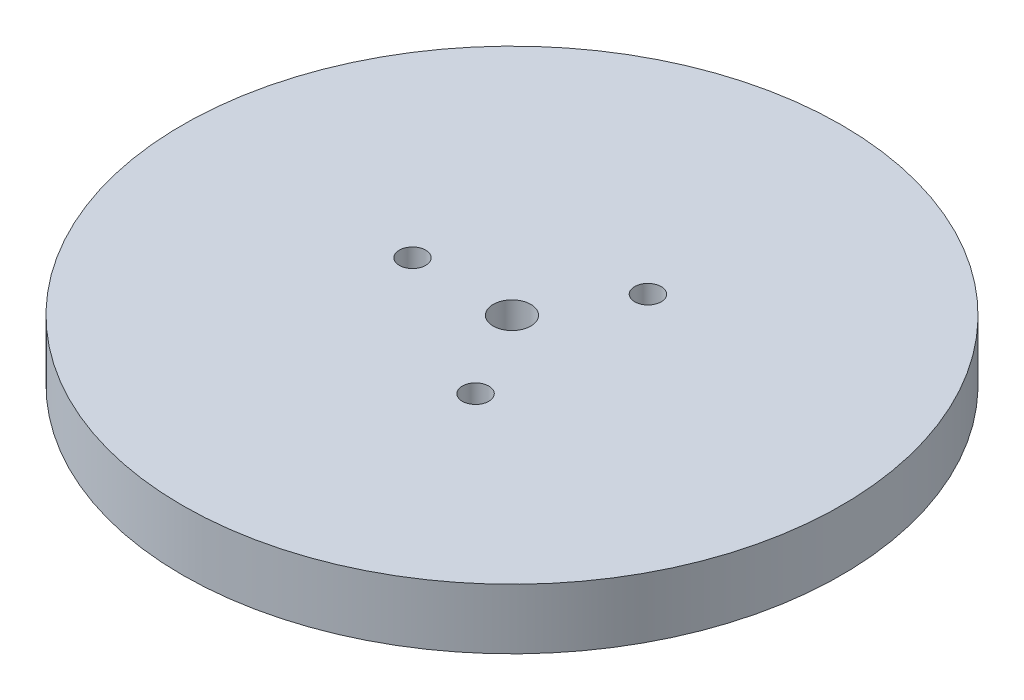
ISO-10303-21;
HEADER;
FILE_DESCRIPTION(('STEP AP214'),'2;1');
FILE_NAME('part.step','',(''),(''),'','','');
FILE_SCHEMA(('AUTOMOTIVE_DESIGN { 1 0 10303 214 1 1 1 1 }'));
ENDSEC;
DATA;
#1=APPLICATION_CONTEXT('core data for automotive mechanical design processes');
#2=APPLICATION_PROTOCOL_DEFINITION('international standard','automotive_design',2000,#1);
#3=PRODUCT_CONTEXT('',#1,'mechanical');
#4=PRODUCT('Part','Part','',(#3));
#5=PRODUCT_RELATED_PRODUCT_CATEGORY('part','',(#4));
#6=PRODUCT_DEFINITION_FORMATION('','',#4);
#7=PRODUCT_DEFINITION_CONTEXT('part definition',#1,'design');
#8=PRODUCT_DEFINITION('design','',#6,#7);
#9=PRODUCT_DEFINITION_SHAPE('','',#8);
#10=(LENGTH_UNIT() NAMED_UNIT(*) SI_UNIT(.MILLI.,.METRE.));
#11=(NAMED_UNIT(*) PLANE_ANGLE_UNIT() SI_UNIT($,.RADIAN.));
#12=(NAMED_UNIT(*) SI_UNIT($,.STERADIAN.) SOLID_ANGLE_UNIT());
#13=UNCERTAINTY_MEASURE_WITH_UNIT(LENGTH_MEASURE(1.E-05),#10,'distance_accuracy_value','');
#14=(GEOMETRIC_REPRESENTATION_CONTEXT(3) GLOBAL_UNCERTAINTY_ASSIGNED_CONTEXT((#13)) GLOBAL_UNIT_ASSIGNED_CONTEXT((#10,
#11,#12)) REPRESENTATION_CONTEXT('',''));
#15=CARTESIAN_POINT('',(0.,0.,0.));
#16=DIRECTION('',(0.,0.,1.));
#17=DIRECTION('',(1.,0.,0.));
#18=AXIS2_PLACEMENT_3D('',#15,#16,#17);
#19=CARTESIAN_POINT('',(0.,16.,0.));
#20=DIRECTION('',(0.,-1.,0.));
#21=DIRECTION('',(0.,0.,-1.));
#22=AXIS2_PLACEMENT_3D('',#19,#20,#21);
#23=CYLINDRICAL_SURFACE('',#22,87.5);
#24=CARTESIAN_POINT('',(0.,16.,0.));
#25=DIRECTION('',(0.,1.,0.));
#26=DIRECTION('',(0.,0.,1.));
#27=AXIS2_PLACEMENT_3D('',#24,#25,#26);
#28=CIRCLE('',#27,87.5);
#29=CARTESIAN_POINT('',(0.,16.,87.5));
#30=VERTEX_POINT('',#29);
#31=EDGE_CURVE('E10',#30,#30,#28,.T.);
#32=ORIENTED_EDGE('',*,*,#31,.F.);
#33=EDGE_LOOP('',(#32));
#34=FACE_BOUND('',#33,.T.);
#35=CARTESIAN_POINT('',(0.,0.,0.));
#36=DIRECTION('',(0.,1.,0.));
#37=DIRECTION('',(0.,0.,1.));
#38=AXIS2_PLACEMENT_3D('',#35,#36,#37);
#39=CIRCLE('',#38,87.5);
#40=CARTESIAN_POINT('',(0.,0.,87.5));
#41=VERTEX_POINT('',#40);
#42=EDGE_CURVE('E37',#41,#41,#39,.T.);
#43=ORIENTED_EDGE('',*,*,#42,.T.);
#44=EDGE_LOOP('',(#43));
#45=FACE_BOUND('',#44,.T.);
#46=ADVANCED_FACE('F40',(#34,#45),#23,.T.);
#47=CARTESIAN_POINT('',(0.,16.,0.));
#48=DIRECTION('',(0.,1.,0.));
#49=DIRECTION('',(0.,0.,1.));
#50=AXIS2_PLACEMENT_3D('',#47,#48,#49);
#51=PLANE('',#50);
#52=CARTESIAN_POINT('',(13.2089168199701,16.,22.8785150451391));
#53=DIRECTION('',(0.,1.,0.));
#54=DIRECTION('',(0.866025403784436,0.,-0.500000000000004));
#55=AXIS2_PLACEMENT_3D('',#52,#53,#54);
#56=CIRCLE('',#55,3.51501800398951);
#57=CARTESIAN_POINT('',(16.2530117061847,16.,21.1210060431443));
#58=VERTEX_POINT('',#57);
#59=EDGE_CURVE('E70',#58,#58,#56,.T.);
#60=ORIENTED_EDGE('',*,*,#59,.F.);
#61=EDGE_LOOP('',(#60));
#62=FACE_BOUND('',#61,.T.);
#63=CARTESIAN_POINT('',(13.2089168199698,16.,-22.8785150451393));
#64=DIRECTION('',(0.,1.,0.));
#65=DIRECTION('',(-0.866025403784443,0.,-0.499999999999992));
#66=AXIS2_PLACEMENT_3D('',#63,#64,#65);
#67=CIRCLE('',#66,3.51501800398951);
#68=CARTESIAN_POINT('',(10.1648219337552,16.,-24.636024047134));
#69=VERTEX_POINT('',#68);
#70=EDGE_CURVE('E61',#69,#69,#67,.T.);
#71=ORIENTED_EDGE('',*,*,#70,.F.);
#72=EDGE_LOOP('',(#71));
#73=FACE_BOUND('',#72,.T.);
#74=CARTESIAN_POINT('',(-26.41783363994,16.,0.));
#75=DIRECTION('',(0.,1.,0.));
#76=DIRECTION('',(0.,0.,1.));
#77=AXIS2_PLACEMENT_3D('',#74,#75,#76);
#78=CIRCLE('',#77,3.51501800398951);
#79=CARTESIAN_POINT('',(-26.41783363994,16.,3.51501800398951));
#80=VERTEX_POINT('',#79);
#81=EDGE_CURVE('E54',#80,#80,#78,.T.);
#82=ORIENTED_EDGE('',*,*,#81,.F.);
#83=EDGE_LOOP('',(#82));
#84=FACE_BOUND('',#83,.T.);
#85=CARTESIAN_POINT('',(0.,16.,0.));
#86=DIRECTION('',(0.,1.,0.));
#87=DIRECTION('',(0.,0.,1.));
#88=AXIS2_PLACEMENT_3D('',#85,#86,#87);
#89=CIRCLE('',#88,5.);
#90=CARTESIAN_POINT('',(0.,16.,5.));
#91=VERTEX_POINT('',#90);
#92=EDGE_CURVE('E50',#91,#91,#89,.T.);
#93=ORIENTED_EDGE('',*,*,#92,.F.);
#94=EDGE_LOOP('',(#93));
#95=FACE_BOUND('',#94,.T.);
#96=ORIENTED_EDGE('',*,*,#31,.T.);
#97=EDGE_LOOP('',(#96));
#98=FACE_BOUND('',#97,.T.);
#99=ADVANCED_FACE('F85',(#62,#73,#84,#95,#98),#51,.T.);
#100=CARTESIAN_POINT('',(0.,0.,0.));
#101=DIRECTION('',(0.,1.,0.));
#102=DIRECTION('',(0.,0.,1.));
#103=AXIS2_PLACEMENT_3D('',#100,#101,#102);
#104=PLANE('',#103);
#105=CARTESIAN_POINT('',(0.,0.,0.));
#106=DIRECTION('',(0.,1.,0.));
#107=DIRECTION('',(0.,0.,1.));
#108=AXIS2_PLACEMENT_3D('',#105,#106,#107);
#109=CIRCLE('',#108,5.);
#110=CARTESIAN_POINT('',(0.,0.,5.));
#111=VERTEX_POINT('',#110);
#112=EDGE_CURVE('E47',#111,#111,#109,.T.);
#113=ORIENTED_EDGE('',*,*,#112,.T.);
#114=EDGE_LOOP('',(#113));
#115=FACE_BOUND('',#114,.T.);
#116=ORIENTED_EDGE('',*,*,#42,.F.);
#117=EDGE_LOOP('',(#116));
#118=FACE_BOUND('',#117,.T.);
#119=ADVANCED_FACE('F84',(#115,#118),#104,.F.);
#120=CARTESIAN_POINT('',(0.,16.,0.));
#121=DIRECTION('',(0.,-1.,0.));
#122=DIRECTION('',(0.,0.,-1.));
#123=AXIS2_PLACEMENT_3D('',#120,#121,#122);
#124=CYLINDRICAL_SURFACE('',#123,5.);
#125=ORIENTED_EDGE('',*,*,#92,.T.);
#126=EDGE_LOOP('',(#125));
#127=FACE_BOUND('',#126,.T.);
#128=ORIENTED_EDGE('',*,*,#112,.F.);
#129=EDGE_LOOP('',(#128));
#130=FACE_BOUND('',#129,.T.);
#131=ADVANCED_FACE('F91',(#127,#130),#124,.F.);
#132=CARTESIAN_POINT('',(-26.41783363994,2.03994392830018,0.));
#133=DIRECTION('',(0.,1.,0.));
#134=DIRECTION('',(0.,0.,1.));
#135=AXIS2_PLACEMENT_3D('',#132,#133,#134);
#136=CYLINDRICAL_SURFACE('',#135,3.51501800398951);
#137=CARTESIAN_POINT('',(-26.41783363994,2.03994392830018,0.));
#138=DIRECTION('',(0.,1.,0.));
#139=DIRECTION('',(0.,0.,1.));
#140=AXIS2_PLACEMENT_3D('',#137,#138,#139);
#141=CIRCLE('',#140,3.51501800398951);
#142=CARTESIAN_POINT('',(-26.41783363994,2.03994392830018,3.51501800398951));
#143=VERTEX_POINT('',#142);
#144=EDGE_CURVE('E55',#143,#143,#141,.T.);
#145=ORIENTED_EDGE('',*,*,#144,.F.);
#146=EDGE_LOOP('',(#145));
#147=FACE_BOUND('',#146,.T.);
#148=ORIENTED_EDGE('',*,*,#81,.T.);
#149=EDGE_LOOP('',(#148));
#150=FACE_BOUND('',#149,.T.);
#151=ADVANCED_FACE('F96',(#147,#150),#136,.F.);
#152=CARTESIAN_POINT('',(-26.41783363994,2.03994392830018,0.));
#153=DIRECTION('',(0.,1.,0.));
#154=DIRECTION('',(0.,0.,1.));
#155=AXIS2_PLACEMENT_3D('',#152,#153,#154);
#156=PLANE('',#155);
#157=ORIENTED_EDGE('',*,*,#144,.T.);
#158=EDGE_LOOP('',(#157));
#159=FACE_BOUND('',#158,.T.);
#160=ADVANCED_FACE('F127',(#159),#156,.T.);
#161=CARTESIAN_POINT('',(13.2089168199698,2.03994392830018,-22.8785150451393));
#162=DIRECTION('',(0.,1.,0.));
#163=DIRECTION('',(0.,0.,1.));
#164=AXIS2_PLACEMENT_3D('',#161,#162,#163);
#165=CYLINDRICAL_SURFACE('',#164,3.51501800398951);
#166=CARTESIAN_POINT('',(13.2089168199698,2.03994392830018,-22.8785150451393));
#167=DIRECTION('',(0.,1.,0.));
#168=DIRECTION('',(-0.866025403784443,0.,-0.499999999999992));
#169=AXIS2_PLACEMENT_3D('',#166,#167,#168);
#170=CIRCLE('',#169,3.51501800398951);
#171=CARTESIAN_POINT('',(10.1648219337552,2.03994392830018,-24.636024047134));
#172=VERTEX_POINT('',#171);
#173=EDGE_CURVE('E63',#172,#172,#170,.T.);
#174=ORIENTED_EDGE('',*,*,#173,.F.);
#175=EDGE_LOOP('',(#174));
#176=FACE_BOUND('',#175,.T.);
#177=ORIENTED_EDGE('',*,*,#70,.T.);
#178=EDGE_LOOP('',(#177));
#179=FACE_BOUND('',#178,.T.);
#180=ADVANCED_FACE('F133',(#176,#179),#165,.F.);
#181=CARTESIAN_POINT('',(13.2089168199698,2.03994392830018,-22.8785150451393));
#182=DIRECTION('',(0.,1.,0.));
#183=DIRECTION('',(-0.866025403784443,0.,-0.499999999999992));
#184=AXIS2_PLACEMENT_3D('',#181,#182,#183);
#185=PLANE('',#184);
#186=ORIENTED_EDGE('',*,*,#173,.T.);
#187=EDGE_LOOP('',(#186));
#188=FACE_BOUND('',#187,.T.);
#189=ADVANCED_FACE('F77',(#188),#185,.T.);
#190=CARTESIAN_POINT('',(13.2089168199701,2.03994392830018,22.8785150451391));
#191=DIRECTION('',(0.,1.,0.));
#192=DIRECTION('',(0.,0.,1.));
#193=AXIS2_PLACEMENT_3D('',#190,#191,#192);
#194=CYLINDRICAL_SURFACE('',#193,3.51501800398951);
#195=CARTESIAN_POINT('',(13.2089168199701,2.03994392830018,22.8785150451391));
#196=DIRECTION('',(0.,1.,0.));
#197=DIRECTION('',(0.866025403784436,0.,-0.500000000000004));
#198=AXIS2_PLACEMENT_3D('',#195,#196,#197);
#199=CIRCLE('',#198,3.51501800398951);
#200=CARTESIAN_POINT('',(16.2530117061847,2.03994392830018,21.1210060431443));
#201=VERTEX_POINT('',#200);
#202=EDGE_CURVE('E59',#201,#201,#199,.T.);
#203=ORIENTED_EDGE('',*,*,#202,.F.);
#204=EDGE_LOOP('',(#203));
#205=FACE_BOUND('',#204,.T.);
#206=ORIENTED_EDGE('',*,*,#59,.T.);
#207=EDGE_LOOP('',(#206));
#208=FACE_BOUND('',#207,.T.);
#209=ADVANCED_FACE('F73',(#205,#208),#194,.F.);
#210=CARTESIAN_POINT('',(13.2089168199701,2.03994392830018,22.8785150451391));
#211=DIRECTION('',(0.,1.,0.));
#212=DIRECTION('',(0.866025403784436,0.,-0.500000000000004));
#213=AXIS2_PLACEMENT_3D('',#210,#211,#212);
#214=PLANE('',#213);
#215=ORIENTED_EDGE('',*,*,#202,.T.);
#216=EDGE_LOOP('',(#215));
#217=FACE_BOUND('',#216,.T.);
#218=ADVANCED_FACE('F71',(#217),#214,.T.);
#219=CLOSED_SHELL('',(#46,#99,#119,#131,#151,#160,#180,#189,#209,#218));
#220=MANIFOLD_SOLID_BREP('B2',#219);
#221=ADVANCED_BREP_SHAPE_REPRESENTATION('',(#18,#220),#14);
#222=SHAPE_DEFINITION_REPRESENTATION(#9,#221);
ENDSEC;
END-ISO-10303-21;
